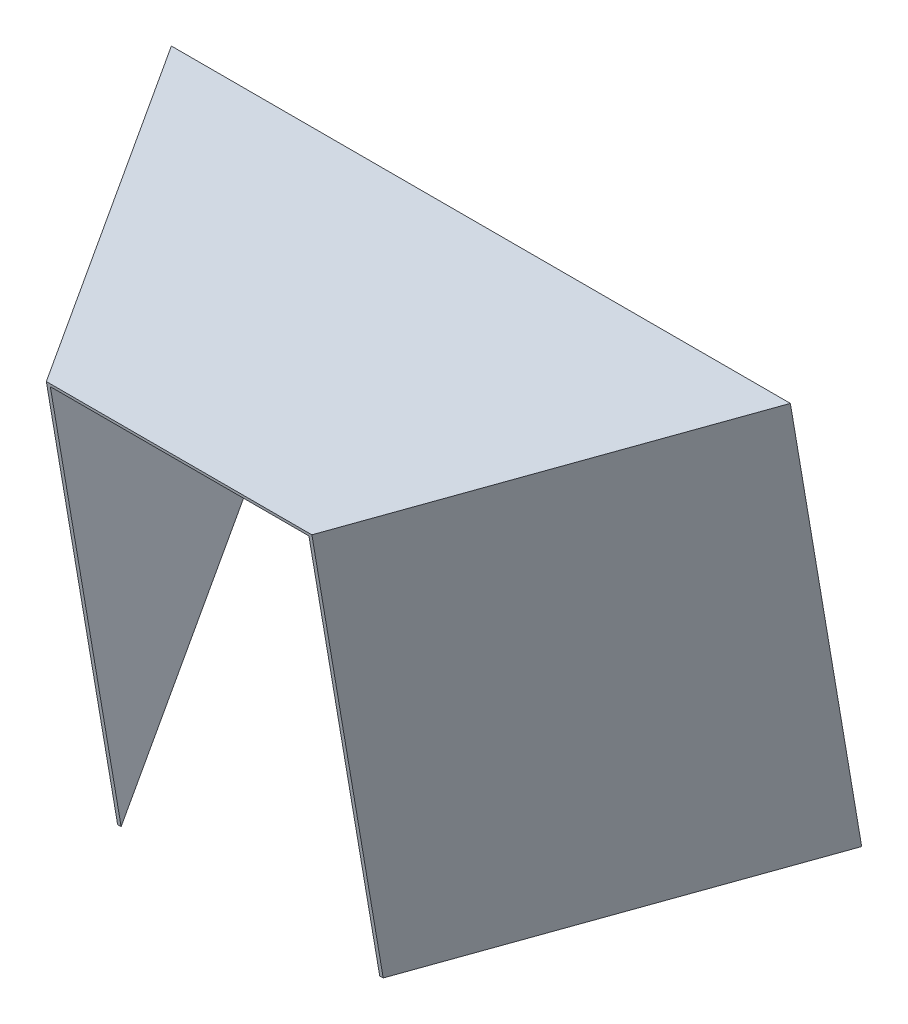
ISO-10303-21;
HEADER;
FILE_DESCRIPTION(('STEP AP214'),'2;1');
FILE_NAME('part.step','',(''),(''),'','','');
FILE_SCHEMA(('AUTOMOTIVE_DESIGN { 1 0 10303 214 1 1 1 1 }'));
ENDSEC;
DATA;
#1=APPLICATION_CONTEXT('core data for automotive mechanical design processes');
#2=APPLICATION_PROTOCOL_DEFINITION('international standard','automotive_design',2000,#1);
#3=PRODUCT_CONTEXT('',#1,'mechanical');
#4=PRODUCT('Part','Part','',(#3));
#5=PRODUCT_RELATED_PRODUCT_CATEGORY('part','',(#4));
#6=PRODUCT_DEFINITION_FORMATION('','',#4);
#7=PRODUCT_DEFINITION_CONTEXT('part definition',#1,'design');
#8=PRODUCT_DEFINITION('design','',#6,#7);
#9=PRODUCT_DEFINITION_SHAPE('','',#8);
#10=(LENGTH_UNIT() NAMED_UNIT(*) SI_UNIT(.MILLI.,.METRE.));
#11=(NAMED_UNIT(*) PLANE_ANGLE_UNIT() SI_UNIT($,.RADIAN.));
#12=(NAMED_UNIT(*) SI_UNIT($,.STERADIAN.) SOLID_ANGLE_UNIT());
#13=UNCERTAINTY_MEASURE_WITH_UNIT(LENGTH_MEASURE(1.E-05),#10,'distance_accuracy_value','');
#14=(GEOMETRIC_REPRESENTATION_CONTEXT(3) GLOBAL_UNCERTAINTY_ASSIGNED_CONTEXT((#13)) GLOBAL_UNIT_ASSIGNED_CONTEXT((#10,
#11,#12)) REPRESENTATION_CONTEXT('',''));
#15=CARTESIAN_POINT('',(0.,0.,0.));
#16=DIRECTION('',(0.,0.,1.));
#17=DIRECTION('',(1.,0.,0.));
#18=AXIS2_PLACEMENT_3D('',#15,#16,#17);
#19=CARTESIAN_POINT('',(0.,487.559529594713,82.8851200311012));
#20=DIRECTION('',(0.,-0.985855846669817,-0.167595493933869));
#21=DIRECTION('',(0.,0.167595493933869,-0.985855846669817));
#22=AXIS2_PLACEMENT_3D('',#19,#20,#21);
#23=PLANE('',#22);
#24=DIRECTION('',(-1.,0.,0.));
#25=VECTOR('',#24,1.);
#26=CARTESIAN_POINT('',(6.35,501.65,0.));
#27=LINE('',#26,#25);
#28=CARTESIAN_POINT('',(-0.982348418708257,501.65,0.));
#29=VERTEX_POINT('',#28);
#30=CARTESIAN_POINT('',(-545.117651581292,501.65,0.));
#31=VERTEX_POINT('',#30);
#32=EDGE_CURVE('E51',#29,#31,#27,.T.);
#33=ORIENTED_EDGE('',*,*,#32,.T.);
#34=DIRECTION('',(0.499999999999998,-0.145141955306532,0.853776207685479));
#35=VECTOR('',#34,1.);
#36=CARTESIAN_POINT('',(-545.117651581292,501.65,0.));
#37=LINE('',#36,#35);
#38=CARTESIAN_POINT('',(-916.994962218369,609.6,-635.));
#39=VERTEX_POINT('',#38);
#40=EDGE_CURVE('E110',#39,#31,#37,.T.);
#41=ORIENTED_EDGE('',*,*,#40,.F.);
#42=DIRECTION('',(-1.,0.,0.));
#43=VECTOR('',#42,1.);
#44=CARTESIAN_POINT('',(6.35,609.6,-635.));
#45=LINE('',#44,#43);
#46=CARTESIAN_POINT('',(370.894962218375,609.6,-635.));
#47=VERTEX_POINT('',#46);
#48=EDGE_CURVE('E11',#47,#39,#45,.T.);
#49=ORIENTED_EDGE('',*,*,#48,.F.);
#50=DIRECTION('',(0.500000000000004,0.145141955306531,-0.853776207685476));
#51=VECTOR('',#50,1.);
#52=CARTESIAN_POINT('',(-0.982348418708257,501.65,0.));
#53=LINE('',#52,#51);
#54=EDGE_CURVE('E121',#29,#47,#53,.T.);
#55=ORIENTED_EDGE('',*,*,#54,.F.);
#56=EDGE_LOOP('',(#33,#41,#49,#55));
#57=FACE_BOUND('',#56,.T.);
#58=ADVANCED_FACE('F42',(#57),#23,.T.);
#59=CARTESIAN_POINT('',(6.35,507.910184626353,1.06423138648005));
#60=DIRECTION('',(0.,0.167595493933869,-0.985855846669817));
#61=DIRECTION('',(0.,0.985855846669817,0.167595493933869));
#62=AXIS2_PLACEMENT_3D('',#59,#60,#61);
#63=PLANE('',#62);
#64=DIRECTION('',(0.,-0.985855846669817,-0.167595493933869));
#65=VECTOR('',#64,1.);
#66=CARTESIAN_POINT('',(-552.45,507.910184626353,1.06423138648011));
#67=LINE('',#66,#65);
#68=CARTESIAN_POINT('',(-552.45,507.910184626353,1.06423138648011));
#69=VERTEX_POINT('',#68);
#70=CARTESIAN_POINT('',(-552.45,-374.775847689467,-148.99239410721));
#71=VERTEX_POINT('',#70);
#72=EDGE_CURVE('E144',#69,#71,#67,.T.);
#73=ORIENTED_EDGE('',*,*,#72,.T.);
#74=DIRECTION('',(-1.,0.,0.));
#75=VECTOR('',#74,1.);
#76=CARTESIAN_POINT('',(-552.45,-374.775847689467,-148.99239410721));
#77=LINE('',#76,#75);
#78=CARTESIAN_POINT('',(-545.117651581292,-374.775847689467,-148.99239410721));
#79=VERTEX_POINT('',#78);
#80=EDGE_CURVE('E128',#79,#71,#77,.T.);
#81=ORIENTED_EDGE('',*,*,#80,.F.);
#82=DIRECTION('',(0.,0.985855846669817,0.167595493933869));
#83=VECTOR('',#82,1.);
#84=CARTESIAN_POINT('',(-545.117651581292,-374.775847689467,-148.99239410721));
#85=LINE('',#84,#83);
#86=EDGE_CURVE('E113',#79,#31,#85,.T.);
#87=ORIENTED_EDGE('',*,*,#86,.T.);
#88=ORIENTED_EDGE('',*,*,#32,.F.);
#89=DIRECTION('',(0.,0.985855846669817,0.167595493933869));
#90=VECTOR('',#89,1.);
#91=CARTESIAN_POINT('',(-0.982348418708272,-374.775847689467,-148.99239410721));
#92=LINE('',#91,#90);
#93=CARTESIAN_POINT('',(-0.982348418708272,-374.775847689467,-148.99239410721));
#94=VERTEX_POINT('',#93);
#95=EDGE_CURVE('E158',#94,#29,#92,.T.);
#96=ORIENTED_EDGE('',*,*,#95,.F.);
#97=DIRECTION('',(-1.,0.,0.));
#98=VECTOR('',#97,1.);
#99=CARTESIAN_POINT('',(6.34999999999999,-374.775847689467,-148.99239410721));
#100=LINE('',#99,#98);
#101=CARTESIAN_POINT('',(6.34999999999999,-374.775847689467,-148.99239410721));
#102=VERTEX_POINT('',#101);
#103=EDGE_CURVE('E169',#102,#94,#100,.T.);
#104=ORIENTED_EDGE('',*,*,#103,.F.);
#105=DIRECTION('',(0.,-0.985855846669817,-0.167595493933869));
#106=VECTOR('',#105,1.);
#107=CARTESIAN_POINT('',(6.35,507.910184626353,1.06423138648005));
#108=LINE('',#107,#106);
#109=CARTESIAN_POINT('',(6.35,507.910184626353,1.06423138648005));
#110=VERTEX_POINT('',#109);
#111=EDGE_CURVE('E134',#110,#102,#108,.T.);
#112=ORIENTED_EDGE('',*,*,#111,.F.);
#113=DIRECTION('',(1.,0.,0.));
#114=VECTOR('',#113,1.);
#115=CARTESIAN_POINT('',(6.35,507.910184626353,1.06423138648005));
#116=LINE('',#115,#114);
#117=EDGE_CURVE('E155',#69,#110,#116,.T.);
#118=ORIENTED_EDGE('',*,*,#117,.F.);
#119=EDGE_LOOP('',(#73,#81,#87,#88,#96,#104,#112,#118));
#120=FACE_BOUND('',#119,.T.);
#121=ADVANCED_FACE('F44',(#120),#63,.F.);
#122=CARTESIAN_POINT('',(6.35,507.910184626353,1.06423138648005));
#123=DIRECTION('',(-0.866025403784436,0.0837977469669351,-0.492927923334913));
#124=DIRECTION('',(-0.494667777054172,0.,0.869082153967209));
#125=AXIS2_PLACEMENT_3D('',#122,#123,#124);
#126=PLANE('',#125);
#127=ORIENTED_EDGE('',*,*,#111,.T.);
#128=DIRECTION('',(-0.500000000000004,-0.145141955306531,0.853776207685476));
#129=VECTOR('',#128,1.);
#130=CARTESIAN_POINT('',(378.227310637083,-266.825847689467,-783.99239410721));
#131=LINE('',#130,#129);
#132=CARTESIAN_POINT('',(378.227310637083,-266.825847689467,-783.99239410721));
#133=VERTEX_POINT('',#132);
#134=EDGE_CURVE('E172',#133,#102,#131,.T.);
#135=ORIENTED_EDGE('',*,*,#134,.F.);
#136=DIRECTION('',(0.,-0.985855846669817,-0.167595493933869));
#137=VECTOR('',#136,1.);
#138=CARTESIAN_POINT('',(378.227310637083,615.860184626353,-633.93576861352));
#139=LINE('',#138,#137);
#140=CARTESIAN_POINT('',(378.227310637083,615.860184626353,-633.93576861352));
#141=VERTEX_POINT('',#140);
#142=EDGE_CURVE('E136',#141,#133,#139,.T.);
#143=ORIENTED_EDGE('',*,*,#142,.F.);
#144=DIRECTION('',(0.500000000000004,0.145141955306531,-0.853776207685476));
#145=VECTOR('',#144,1.);
#146=CARTESIAN_POINT('',(6.35,507.910184626353,1.06423138648005));
#147=LINE('',#146,#145);
#148=EDGE_CURVE('E152',#110,#141,#147,.T.);
#149=ORIENTED_EDGE('',*,*,#148,.F.);
#150=EDGE_LOOP('',(#127,#135,#143,#149));
#151=FACE_BOUND('',#150,.T.);
#152=ADVANCED_FACE('F207',(#151),#126,.F.);
#153=CARTESIAN_POINT('',(378.227310637083,615.860184626353,-633.93576861352));
#154=DIRECTION('',(0.,-0.167595493933869,0.985855846669817));
#155=DIRECTION('',(0.,-0.985855846669817,-0.167595493933869));
#156=AXIS2_PLACEMENT_3D('',#153,#154,#155);
#157=PLANE('',#156);
#158=ORIENTED_EDGE('',*,*,#142,.T.);
#159=DIRECTION('',(1.,0.,0.));
#160=VECTOR('',#159,1.);
#161=CARTESIAN_POINT('',(370.894962218375,-266.825847689467,-783.99239410721));
#162=LINE('',#161,#160);
#163=CARTESIAN_POINT('',(370.894962218375,-266.825847689467,-783.99239410721));
#164=VERTEX_POINT('',#163);
#165=EDGE_CURVE('E166',#164,#133,#162,.T.);
#166=ORIENTED_EDGE('',*,*,#165,.F.);
#167=DIRECTION('',(0.,0.985855846669817,0.167595493933869));
#168=VECTOR('',#167,1.);
#169=CARTESIAN_POINT('',(370.894962218375,-266.825847689467,-783.99239410721));
#170=LINE('',#169,#168);
#171=EDGE_CURVE('E57',#164,#47,#170,.T.);
#172=ORIENTED_EDGE('',*,*,#171,.T.);
#173=ORIENTED_EDGE('',*,*,#48,.T.);
#174=DIRECTION('',(0.,0.985855846669817,0.167595493933869));
#175=VECTOR('',#174,1.);
#176=CARTESIAN_POINT('',(-916.994962218369,-266.825847689467,-783.99239410721));
#177=LINE('',#176,#175);
#178=CARTESIAN_POINT('',(-916.994962218369,-266.825847689467,-783.99239410721));
#179=VERTEX_POINT('',#178);
#180=EDGE_CURVE('E116',#179,#39,#177,.T.);
#181=ORIENTED_EDGE('',*,*,#180,.F.);
#182=DIRECTION('',(1.,0.,0.));
#183=VECTOR('',#182,1.);
#184=CARTESIAN_POINT('',(-916.994962218369,-266.825847689467,-783.99239410721));
#185=LINE('',#184,#183);
#186=CARTESIAN_POINT('',(-924.327310637077,-266.825847689467,-783.992394107209));
#187=VERTEX_POINT('',#186);
#188=EDGE_CURVE('E122',#187,#179,#185,.T.);
#189=ORIENTED_EDGE('',*,*,#188,.F.);
#190=DIRECTION('',(0.,-0.985855846669817,-0.167595493933869));
#191=VECTOR('',#190,1.);
#192=CARTESIAN_POINT('',(-924.327310637077,615.860184626353,-633.93576861352));
#193=LINE('',#192,#191);
#194=CARTESIAN_POINT('',(-924.327310637077,615.860184626353,-633.93576861352));
#195=VERTEX_POINT('',#194);
#196=EDGE_CURVE('E141',#195,#187,#193,.T.);
#197=ORIENTED_EDGE('',*,*,#196,.F.);
#198=DIRECTION('',(-1.,0.,0.));
#199=VECTOR('',#198,1.);
#200=CARTESIAN_POINT('',(378.227310637083,615.860184626353,-633.93576861352));
#201=LINE('',#200,#199);
#202=EDGE_CURVE('E149',#141,#195,#201,.T.);
#203=ORIENTED_EDGE('',*,*,#202,.F.);
#204=EDGE_LOOP('',(#158,#166,#172,#173,#181,#189,#197,#203));
#205=FACE_BOUND('',#204,.T.);
#206=ADVANCED_FACE('F197',(#205),#157,.F.);
#207=CARTESIAN_POINT('',(-552.45,507.910184626353,1.06423138648011));
#208=DIRECTION('',(0.866025403784439,0.0837977469669342,-0.492927923334907));
#209=DIRECTION('',(-0.494667777054167,0.,-0.869082153967212));
#210=AXIS2_PLACEMENT_3D('',#207,#208,#209);
#211=PLANE('',#210);
#212=ORIENTED_EDGE('',*,*,#196,.T.);
#213=DIRECTION('',(-0.499999999999998,0.145141955306532,-0.853776207685479));
#214=VECTOR('',#213,1.);
#215=CARTESIAN_POINT('',(-924.327310637077,-266.825847689467,-783.992394107209));
#216=LINE('',#215,#214);
#217=EDGE_CURVE('E130',#71,#187,#216,.T.);
#218=ORIENTED_EDGE('',*,*,#217,.F.);
#219=ORIENTED_EDGE('',*,*,#72,.F.);
#220=DIRECTION('',(0.499999999999998,-0.145141955306531,0.853776207685479));
#221=VECTOR('',#220,1.);
#222=CARTESIAN_POINT('',(-552.45,507.910184626353,1.06423138648011));
#223=LINE('',#222,#221);
#224=EDGE_CURVE('E65',#195,#69,#223,.T.);
#225=ORIENTED_EDGE('',*,*,#224,.F.);
#226=EDGE_LOOP('',(#212,#218,#219,#225));
#227=FACE_BOUND('',#226,.T.);
#228=ADVANCED_FACE('F199',(#227),#211,.F.);
#229=CARTESIAN_POINT('',(0.,493.819714221066,83.9493514175813));
#230=DIRECTION('',(0.,-0.985855846669817,-0.167595493933869));
#231=DIRECTION('',(0.,0.167595493933869,-0.985855846669817));
#232=AXIS2_PLACEMENT_3D('',#229,#230,#231);
#233=PLANE('',#232);
#234=ORIENTED_EDGE('',*,*,#117,.T.);
#235=ORIENTED_EDGE('',*,*,#148,.T.);
#236=ORIENTED_EDGE('',*,*,#202,.T.);
#237=ORIENTED_EDGE('',*,*,#224,.T.);
#238=EDGE_LOOP('',(#234,#235,#236,#237));
#239=FACE_BOUND('',#238,.T.);
#240=ADVANCED_FACE('F203',(#239),#233,.F.);
#241=CARTESIAN_POINT('',(-0.982348418708272,-374.775847689467,-148.99239410721));
#242=DIRECTION('',(0.866025403784437,-0.0837977469669352,0.492927923334913));
#243=DIRECTION('',(0.494667777054172,0.,-0.869082153967209));
#244=AXIS2_PLACEMENT_3D('',#241,#242,#243);
#245=PLANE('',#244);
#246=ORIENTED_EDGE('',*,*,#54,.T.);
#247=ORIENTED_EDGE('',*,*,#171,.F.);
#248=DIRECTION('',(0.500000000000004,0.145141955306531,-0.853776207685476));
#249=VECTOR('',#248,1.);
#250=CARTESIAN_POINT('',(-0.982348418708272,-374.775847689467,-148.99239410721));
#251=LINE('',#250,#249);
#252=EDGE_CURVE('E163',#94,#164,#251,.T.);
#253=ORIENTED_EDGE('',*,*,#252,.F.);
#254=ORIENTED_EDGE('',*,*,#95,.T.);
#255=EDGE_LOOP('',(#246,#247,#253,#254));
#256=FACE_BOUND('',#255,.T.);
#257=ADVANCED_FACE('F212',(#256),#245,.F.);
#258=CARTESIAN_POINT('',(0.,-388.866318094755,-66.1072740761083));
#259=DIRECTION('',(0.,-0.985855846669817,-0.167595493933869));
#260=DIRECTION('',(0.,0.167595493933869,-0.985855846669817));
#261=AXIS2_PLACEMENT_3D('',#258,#259,#260);
#262=PLANE('',#261);
#263=ORIENTED_EDGE('',*,*,#165,.T.);
#264=ORIENTED_EDGE('',*,*,#134,.T.);
#265=ORIENTED_EDGE('',*,*,#103,.T.);
#266=ORIENTED_EDGE('',*,*,#252,.T.);
#267=EDGE_LOOP('',(#263,#264,#265,#266));
#268=FACE_BOUND('',#267,.T.);
#269=ADVANCED_FACE('F209',(#268),#262,.T.);
#270=CARTESIAN_POINT('',(-545.117651581292,-374.775847689467,-148.99239410721));
#271=DIRECTION('',(-0.86602540378444,-0.0837977469669341,0.492927923334906));
#272=DIRECTION('',(0.494667777054166,0.,0.869082153967212));
#273=AXIS2_PLACEMENT_3D('',#270,#271,#272);
#274=PLANE('',#273);
#275=ORIENTED_EDGE('',*,*,#40,.T.);
#276=ORIENTED_EDGE('',*,*,#86,.F.);
#277=DIRECTION('',(0.499999999999998,-0.145141955306532,0.853776207685479));
#278=VECTOR('',#277,1.);
#279=CARTESIAN_POINT('',(-545.117651581292,-374.775847689467,-148.99239410721));
#280=LINE('',#279,#278);
#281=EDGE_CURVE('E182',#179,#79,#280,.T.);
#282=ORIENTED_EDGE('',*,*,#281,.F.);
#283=ORIENTED_EDGE('',*,*,#180,.T.);
#284=EDGE_LOOP('',(#275,#276,#282,#283));
#285=FACE_BOUND('',#284,.T.);
#286=ADVANCED_FACE('F112',(#285),#274,.F.);
#287=CARTESIAN_POINT('',(3.75019894288558E-12,-388.866318094758,-66.107274076111));
#288=DIRECTION('',(0.,0.985855846669818,0.167595493933865));
#289=DIRECTION('',(0.,-0.167595493933865,0.985855846669818));
#290=AXIS2_PLACEMENT_3D('',#287,#288,#289);
#291=PLANE('',#290);
#292=ORIENTED_EDGE('',*,*,#188,.T.);
#293=ORIENTED_EDGE('',*,*,#281,.T.);
#294=ORIENTED_EDGE('',*,*,#80,.T.);
#295=ORIENTED_EDGE('',*,*,#217,.T.);
#296=EDGE_LOOP('',(#292,#293,#294,#295));
#297=FACE_BOUND('',#296,.T.);
#298=ADVANCED_FACE('F194',(#297),#291,.F.);
#299=CLOSED_SHELL('',(#58,#121,#152,#206,#228,#240,#257,#269,#286,#298));
#300=MANIFOLD_SOLID_BREP('B2',#299);
#301=ADVANCED_BREP_SHAPE_REPRESENTATION('',(#18,#300),#14);
#302=SHAPE_DEFINITION_REPRESENTATION(#9,#301);
ENDSEC;
END-ISO-10303-21;
